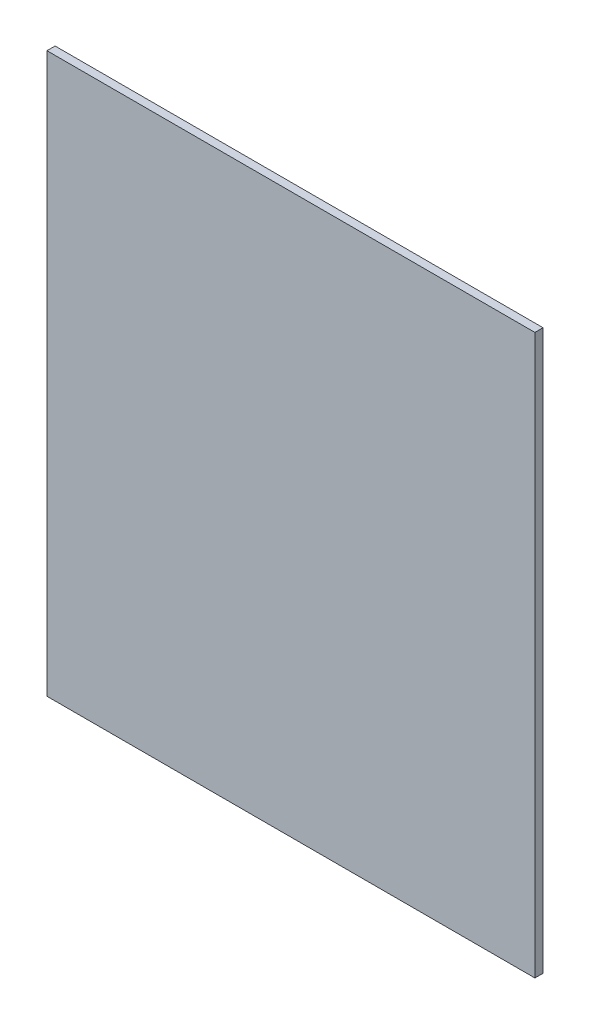
ISO-10303-21;
HEADER;
FILE_DESCRIPTION(('STEP AP214'),'2;1');
FILE_NAME('part.step','',(''),(''),'','','');
FILE_SCHEMA(('AUTOMOTIVE_DESIGN { 1 0 10303 214 1 1 1 1 }'));
ENDSEC;
DATA;
#1=APPLICATION_CONTEXT('core data for automotive mechanical design processes');
#2=APPLICATION_PROTOCOL_DEFINITION('international standard','automotive_design',2000,#1);
#3=PRODUCT_CONTEXT('',#1,'mechanical');
#4=PRODUCT('Part','Part','',(#3));
#5=PRODUCT_RELATED_PRODUCT_CATEGORY('part','',(#4));
#6=PRODUCT_DEFINITION_FORMATION('','',#4);
#7=PRODUCT_DEFINITION_CONTEXT('part definition',#1,'design');
#8=PRODUCT_DEFINITION('design','',#6,#7);
#9=PRODUCT_DEFINITION_SHAPE('','',#8);
#10=(LENGTH_UNIT() NAMED_UNIT(*) SI_UNIT(.MILLI.,.METRE.));
#11=(NAMED_UNIT(*) PLANE_ANGLE_UNIT() SI_UNIT($,.RADIAN.));
#12=(NAMED_UNIT(*) SI_UNIT($,.STERADIAN.) SOLID_ANGLE_UNIT());
#13=UNCERTAINTY_MEASURE_WITH_UNIT(LENGTH_MEASURE(1.E-05),#10,'distance_accuracy_value','');
#14=(GEOMETRIC_REPRESENTATION_CONTEXT(3) GLOBAL_UNCERTAINTY_ASSIGNED_CONTEXT((#13)) GLOBAL_UNIT_ASSIGNED_CONTEXT((#10,
#11,#12)) REPRESENTATION_CONTEXT('',''));
#15=CARTESIAN_POINT('',(0.,0.,0.));
#16=DIRECTION('',(0.,0.,1.));
#17=DIRECTION('',(1.,0.,0.));
#18=AXIS2_PLACEMENT_3D('',#15,#16,#17);
#19=CARTESIAN_POINT('',(-48.,-55.,1.6));
#20=DIRECTION('',(1.,0.,0.));
#21=DIRECTION('',(0.,1.,0.));
#22=AXIS2_PLACEMENT_3D('',#19,#20,#21);
#23=PLANE('',#22);
#24=DIRECTION('',(0.,-1.,0.));
#25=VECTOR('',#24,1.);
#26=CARTESIAN_POINT('',(-48.,-55.,0.));
#27=LINE('',#26,#25);
#28=CARTESIAN_POINT('',(-48.,55.,0.));
#29=VERTEX_POINT('',#28);
#30=CARTESIAN_POINT('',(-48.,-55.,0.));
#31=VERTEX_POINT('',#30);
#32=EDGE_CURVE('E107',#29,#31,#27,.T.);
#33=ORIENTED_EDGE('',*,*,#32,.T.);
#34=DIRECTION('',(0.,0.,-1.));
#35=VECTOR('',#34,1.);
#36=CARTESIAN_POINT('',(-48.,-55.,1.6));
#37=LINE('',#36,#35);
#38=CARTESIAN_POINT('',(-48.,-55.,1.6));
#39=VERTEX_POINT('',#38);
#40=EDGE_CURVE('E11',#39,#31,#37,.T.);
#41=ORIENTED_EDGE('',*,*,#40,.F.);
#42=DIRECTION('',(0.,-1.,0.));
#43=VECTOR('',#42,1.);
#44=CARTESIAN_POINT('',(-48.,-55.,1.6));
#45=LINE('',#44,#43);
#46=CARTESIAN_POINT('',(-48.,55.,1.6));
#47=VERTEX_POINT('',#46);
#48=EDGE_CURVE('E91',#47,#39,#45,.T.);
#49=ORIENTED_EDGE('',*,*,#48,.F.);
#50=DIRECTION('',(0.,0.,-1.));
#51=VECTOR('',#50,1.);
#52=CARTESIAN_POINT('',(-48.,55.,1.6));
#53=LINE('',#52,#51);
#54=EDGE_CURVE('E103',#47,#29,#53,.T.);
#55=ORIENTED_EDGE('',*,*,#54,.T.);
#56=EDGE_LOOP('',(#33,#41,#49,#55));
#57=FACE_BOUND('',#56,.T.);
#58=ADVANCED_FACE('F39',(#57),#23,.F.);
#59=CARTESIAN_POINT('',(48.,-55.,1.6));
#60=DIRECTION('',(0.,1.,0.));
#61=DIRECTION('',(-1.,0.,0.));
#62=AXIS2_PLACEMENT_3D('',#59,#60,#61);
#63=PLANE('',#62);
#64=DIRECTION('',(1.,0.,0.));
#65=VECTOR('',#64,1.);
#66=CARTESIAN_POINT('',(48.,-55.,0.));
#67=LINE('',#66,#65);
#68=CARTESIAN_POINT('',(48.,-55.,0.));
#69=VERTEX_POINT('',#68);
#70=EDGE_CURVE('E96',#31,#69,#67,.T.);
#71=ORIENTED_EDGE('',*,*,#70,.T.);
#72=DIRECTION('',(0.,0.,-1.));
#73=VECTOR('',#72,1.);
#74=CARTESIAN_POINT('',(48.,-55.,1.6));
#75=LINE('',#74,#73);
#76=CARTESIAN_POINT('',(48.,-55.,1.6));
#77=VERTEX_POINT('',#76);
#78=EDGE_CURVE('E48',#77,#69,#75,.T.);
#79=ORIENTED_EDGE('',*,*,#78,.F.);
#80=DIRECTION('',(1.,0.,0.));
#81=VECTOR('',#80,1.);
#82=CARTESIAN_POINT('',(48.,-55.,1.6));
#83=LINE('',#82,#81);
#84=EDGE_CURVE('E86',#39,#77,#83,.T.);
#85=ORIENTED_EDGE('',*,*,#84,.F.);
#86=ORIENTED_EDGE('',*,*,#40,.T.);
#87=EDGE_LOOP('',(#71,#79,#85,#86));
#88=FACE_BOUND('',#87,.T.);
#89=ADVANCED_FACE('F95',(#88),#63,.F.);
#90=CARTESIAN_POINT('',(48.,-55.,1.6));
#91=DIRECTION('',(-1.,0.,0.));
#92=DIRECTION('',(0.,0.,1.));
#93=AXIS2_PLACEMENT_3D('',#90,#91,#92);
#94=PLANE('',#93);
#95=DIRECTION('',(0.,1.,0.));
#96=VECTOR('',#95,1.);
#97=CARTESIAN_POINT('',(48.,-55.,0.));
#98=LINE('',#97,#96);
#99=CARTESIAN_POINT('',(48.,55.,0.));
#100=VERTEX_POINT('',#99);
#101=EDGE_CURVE('E73',#69,#100,#98,.T.);
#102=ORIENTED_EDGE('',*,*,#101,.T.);
#103=DIRECTION('',(0.,0.,-1.));
#104=VECTOR('',#103,1.);
#105=CARTESIAN_POINT('',(48.,55.,1.6));
#106=LINE('',#105,#104);
#107=CARTESIAN_POINT('',(48.,55.,1.6));
#108=VERTEX_POINT('',#107);
#109=EDGE_CURVE('E98',#108,#100,#106,.T.);
#110=ORIENTED_EDGE('',*,*,#109,.F.);
#111=DIRECTION('',(0.,1.,0.));
#112=VECTOR('',#111,1.);
#113=CARTESIAN_POINT('',(48.,-55.,1.6));
#114=LINE('',#113,#112);
#115=EDGE_CURVE('E89',#77,#108,#114,.T.);
#116=ORIENTED_EDGE('',*,*,#115,.F.);
#117=ORIENTED_EDGE('',*,*,#78,.T.);
#118=EDGE_LOOP('',(#102,#110,#116,#117));
#119=FACE_BOUND('',#118,.T.);
#120=ADVANCED_FACE('F99',(#119),#94,.F.);
#121=CARTESIAN_POINT('',(48.,55.,1.6));
#122=DIRECTION('',(0.,-1.,0.));
#123=DIRECTION('',(1.,0.,0.));
#124=AXIS2_PLACEMENT_3D('',#121,#122,#123);
#125=PLANE('',#124);
#126=DIRECTION('',(-1.,0.,0.));
#127=VECTOR('',#126,1.);
#128=CARTESIAN_POINT('',(48.,55.,0.));
#129=LINE('',#128,#127);
#130=EDGE_CURVE('E79',#100,#29,#129,.T.);
#131=ORIENTED_EDGE('',*,*,#130,.T.);
#132=ORIENTED_EDGE('',*,*,#54,.F.);
#133=DIRECTION('',(-1.,0.,0.));
#134=VECTOR('',#133,1.);
#135=CARTESIAN_POINT('',(48.,55.,1.6));
#136=LINE('',#135,#134);
#137=EDGE_CURVE('E56',#108,#47,#136,.T.);
#138=ORIENTED_EDGE('',*,*,#137,.F.);
#139=ORIENTED_EDGE('',*,*,#109,.T.);
#140=EDGE_LOOP('',(#131,#132,#138,#139));
#141=FACE_BOUND('',#140,.T.);
#142=ADVANCED_FACE('F120',(#141),#125,.F.);
#143=CARTESIAN_POINT('',(0.,0.,1.6));
#144=DIRECTION('',(0.,0.,1.));
#145=DIRECTION('',(1.,0.,0.));
#146=AXIS2_PLACEMENT_3D('',#143,#144,#145);
#147=PLANE('',#146);
#148=ORIENTED_EDGE('',*,*,#48,.T.);
#149=ORIENTED_EDGE('',*,*,#84,.T.);
#150=ORIENTED_EDGE('',*,*,#115,.T.);
#151=ORIENTED_EDGE('',*,*,#137,.T.);
#152=EDGE_LOOP('',(#148,#149,#150,#151));
#153=FACE_BOUND('',#152,.T.);
#154=ADVANCED_FACE('F87',(#153),#147,.T.);
#155=CARTESIAN_POINT('',(0.,0.,0.));
#156=DIRECTION('',(0.,0.,1.));
#157=DIRECTION('',(1.,0.,0.));
#158=AXIS2_PLACEMENT_3D('',#155,#156,#157);
#159=PLANE('',#158);
#160=ORIENTED_EDGE('',*,*,#32,.F.);
#161=ORIENTED_EDGE('',*,*,#130,.F.);
#162=ORIENTED_EDGE('',*,*,#101,.F.);
#163=ORIENTED_EDGE('',*,*,#70,.F.);
#164=EDGE_LOOP('',(#160,#161,#162,#163));
#165=FACE_BOUND('',#164,.T.);
#166=ADVANCED_FACE('F123',(#165),#159,.F.);
#167=CLOSED_SHELL('',(#58,#89,#120,#142,#154,#166));
#168=MANIFOLD_SOLID_BREP('B2',#167);
#169=ADVANCED_BREP_SHAPE_REPRESENTATION('',(#18,#168),#14);
#170=SHAPE_DEFINITION_REPRESENTATION(#9,#169);
ENDSEC;
END-ISO-10303-21;
